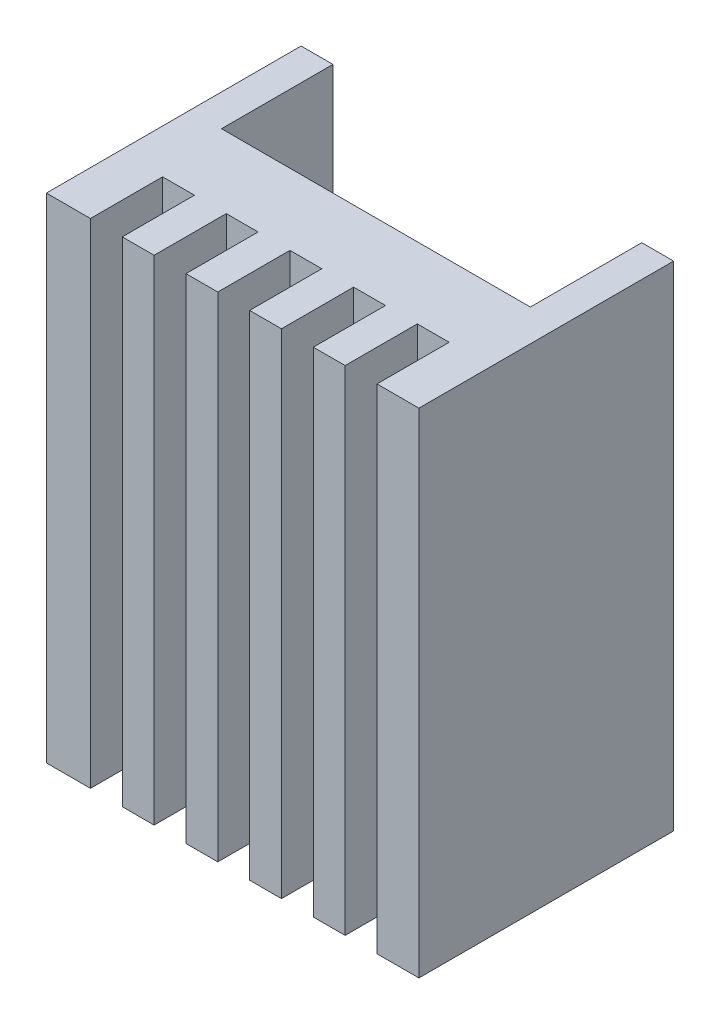
ISO-10303-21;
HEADER;
FILE_DESCRIPTION(('STEP AP214'),'2;1');
FILE_NAME('part.step','',(''),(''),'','','');
FILE_SCHEMA(('AUTOMOTIVE_DESIGN { 1 0 10303 214 1 1 1 1 }'));
ENDSEC;
DATA;
#1=APPLICATION_CONTEXT('core data for automotive mechanical design processes');
#2=APPLICATION_PROTOCOL_DEFINITION('international standard','automotive_design',2000,#1);
#3=PRODUCT_CONTEXT('',#1,'mechanical');
#4=PRODUCT('Part','Part','',(#3));
#5=PRODUCT_RELATED_PRODUCT_CATEGORY('part','',(#4));
#6=PRODUCT_DEFINITION_FORMATION('','',#4);
#7=PRODUCT_DEFINITION_CONTEXT('part definition',#1,'design');
#8=PRODUCT_DEFINITION('design','',#6,#7);
#9=PRODUCT_DEFINITION_SHAPE('','',#8);
#10=(LENGTH_UNIT() NAMED_UNIT(*) SI_UNIT(.MILLI.,.METRE.));
#11=(NAMED_UNIT(*) PLANE_ANGLE_UNIT() SI_UNIT($,.RADIAN.));
#12=(NAMED_UNIT(*) SI_UNIT($,.STERADIAN.) SOLID_ANGLE_UNIT());
#13=UNCERTAINTY_MEASURE_WITH_UNIT(LENGTH_MEASURE(1.E-05),#10,'distance_accuracy_value','');
#14=(GEOMETRIC_REPRESENTATION_CONTEXT(3) GLOBAL_UNCERTAINTY_ASSIGNED_CONTEXT((#13)) GLOBAL_UNIT_ASSIGNED_CONTEXT((#10,
#11,#12)) REPRESENTATION_CONTEXT('',''));
#15=CARTESIAN_POINT('',(0.,0.,0.));
#16=DIRECTION('',(0.,0.,1.));
#17=DIRECTION('',(1.,0.,0.));
#18=AXIS2_PLACEMENT_3D('',#15,#16,#17);
#19=CARTESIAN_POINT('',(0.,31.,0.));
#20=DIRECTION('',(0.,0.,-1.));
#21=DIRECTION('',(-1.,0.,0.));
#22=AXIS2_PLACEMENT_3D('',#19,#20,#21);
#23=PLANE('',#22);
#24=DIRECTION('',(1.,0.,0.));
#25=VECTOR('',#24,1.);
#26=CARTESIAN_POINT('',(0.,0.,0.));
#27=LINE('',#26,#25);
#28=CARTESIAN_POINT('',(16.7666688810726,0.,0.));
#29=VERTEX_POINT('',#28);
#30=CARTESIAN_POINT('',(18.7666688810726,0.,0.));
#31=VERTEX_POINT('',#30);
#32=EDGE_CURVE('E241',#29,#31,#27,.T.);
#33=ORIENTED_EDGE('',*,*,#32,.T.);
#34=DIRECTION('',(0.,1.,0.));
#35=VECTOR('',#34,1.);
#36=CARTESIAN_POINT('',(18.7666688810726,0.,0.));
#37=LINE('',#36,#35);
#38=CARTESIAN_POINT('',(18.7666688810726,31.,0.));
#39=VERTEX_POINT('',#38);
#40=EDGE_CURVE('E297',#31,#39,#37,.T.);
#41=ORIENTED_EDGE('',*,*,#40,.T.);
#42=DIRECTION('',(1.,0.,0.));
#43=VECTOR('',#42,1.);
#44=CARTESIAN_POINT('',(0.,31.,0.));
#45=LINE('',#44,#43);
#46=CARTESIAN_POINT('',(16.7666688810726,31.,0.));
#47=VERTEX_POINT('',#46);
#48=EDGE_CURVE('E431',#47,#39,#45,.T.);
#49=ORIENTED_EDGE('',*,*,#48,.F.);
#50=DIRECTION('',(0.,1.,0.));
#51=VECTOR('',#50,1.);
#52=CARTESIAN_POINT('',(16.7666688810726,0.,0.));
#53=LINE('',#52,#51);
#54=EDGE_CURVE('E285',#29,#47,#53,.T.);
#55=ORIENTED_EDGE('',*,*,#54,.F.);
#56=EDGE_LOOP('',(#33,#41,#49,#55));
#57=FACE_BOUND('',#56,.T.);
#58=ADVANCED_FACE('F32',(#57),#23,.F.);
#59=CARTESIAN_POINT('',(12.7666688810726,0.,0.));
#60=VERTEX_POINT('',#59);
#61=CARTESIAN_POINT('',(14.7666688810726,0.,0.));
#62=VERTEX_POINT('',#61);
#63=EDGE_CURVE('E246',#60,#62,#27,.T.);
#64=ORIENTED_EDGE('',*,*,#63,.T.);
#65=DIRECTION('',(0.,1.,0.));
#66=VECTOR('',#65,1.);
#67=CARTESIAN_POINT('',(14.7666688810726,0.,0.));
#68=LINE('',#67,#66);
#69=CARTESIAN_POINT('',(14.7666688810726,31.,0.));
#70=VERTEX_POINT('',#69);
#71=EDGE_CURVE('E274',#62,#70,#68,.T.);
#72=ORIENTED_EDGE('',*,*,#71,.T.);
#73=CARTESIAN_POINT('',(12.7666688810726,31.,0.));
#74=VERTEX_POINT('',#73);
#75=EDGE_CURVE('E432',#74,#70,#45,.T.);
#76=ORIENTED_EDGE('',*,*,#75,.F.);
#77=DIRECTION('',(0.,1.,0.));
#78=VECTOR('',#77,1.);
#79=CARTESIAN_POINT('',(12.7666688810726,0.,0.));
#80=LINE('',#79,#78);
#81=EDGE_CURVE('E276',#60,#74,#80,.T.);
#82=ORIENTED_EDGE('',*,*,#81,.F.);
#83=EDGE_LOOP('',(#64,#72,#76,#82));
#84=FACE_BOUND('',#83,.T.);
#85=ADVANCED_FACE('F272',(#84),#23,.F.);
#86=CARTESIAN_POINT('',(8.76666888107257,0.,0.));
#87=VERTEX_POINT('',#86);
#88=CARTESIAN_POINT('',(10.7666688810726,0.,0.));
#89=VERTEX_POINT('',#88);
#90=EDGE_CURVE('E257',#87,#89,#27,.T.);
#91=ORIENTED_EDGE('',*,*,#90,.T.);
#92=DIRECTION('',(0.,1.,0.));
#93=VECTOR('',#92,1.);
#94=CARTESIAN_POINT('',(10.7666688810726,0.,0.));
#95=LINE('',#94,#93);
#96=CARTESIAN_POINT('',(10.7666688810726,31.,0.));
#97=VERTEX_POINT('',#96);
#98=EDGE_CURVE('E320',#89,#97,#95,.T.);
#99=ORIENTED_EDGE('',*,*,#98,.T.);
#100=CARTESIAN_POINT('',(8.76666888107257,31.,0.));
#101=VERTEX_POINT('',#100);
#102=EDGE_CURVE('E436',#101,#97,#45,.T.);
#103=ORIENTED_EDGE('',*,*,#102,.F.);
#104=DIRECTION('',(0.,1.,0.));
#105=VECTOR('',#104,1.);
#106=CARTESIAN_POINT('',(8.76666888107257,0.,0.));
#107=LINE('',#106,#105);
#108=EDGE_CURVE('E338',#87,#101,#107,.T.);
#109=ORIENTED_EDGE('',*,*,#108,.F.);
#110=EDGE_LOOP('',(#91,#99,#103,#109));
#111=FACE_BOUND('',#110,.T.);
#112=ADVANCED_FACE('F458',(#111),#23,.F.);
#113=CARTESIAN_POINT('',(4.76666888107258,0.,0.));
#114=VERTEX_POINT('',#113);
#115=CARTESIAN_POINT('',(6.76666888107257,0.,0.));
#116=VERTEX_POINT('',#115);
#117=EDGE_CURVE('E252',#114,#116,#27,.T.);
#118=ORIENTED_EDGE('',*,*,#117,.T.);
#119=DIRECTION('',(0.,1.,0.));
#120=VECTOR('',#119,1.);
#121=CARTESIAN_POINT('',(6.76666888107257,0.,0.));
#122=LINE('',#121,#120);
#123=CARTESIAN_POINT('',(6.76666888107257,31.,0.));
#124=VERTEX_POINT('',#123);
#125=EDGE_CURVE('E345',#116,#124,#122,.T.);
#126=ORIENTED_EDGE('',*,*,#125,.T.);
#127=CARTESIAN_POINT('',(4.76666888107258,31.,0.));
#128=VERTEX_POINT('',#127);
#129=EDGE_CURVE('E384',#128,#124,#45,.T.);
#130=ORIENTED_EDGE('',*,*,#129,.F.);
#131=DIRECTION('',(0.,1.,0.));
#132=VECTOR('',#131,1.);
#133=CARTESIAN_POINT('',(4.76666888107258,0.,0.));
#134=LINE('',#133,#132);
#135=EDGE_CURVE('E373',#114,#128,#134,.T.);
#136=ORIENTED_EDGE('',*,*,#135,.F.);
#137=EDGE_LOOP('',(#118,#126,#130,#136));
#138=FACE_BOUND('',#137,.T.);
#139=ADVANCED_FACE('F449',(#138),#23,.F.);
#140=CARTESIAN_POINT('',(0.,0.,0.));
#141=VERTEX_POINT('',#140);
#142=CARTESIAN_POINT('',(2.76666888107258,0.,0.));
#143=VERTEX_POINT('',#142);
#144=EDGE_CURVE('E244',#141,#143,#27,.T.);
#145=ORIENTED_EDGE('',*,*,#144,.T.);
#146=DIRECTION('',(0.,1.,0.));
#147=VECTOR('',#146,1.);
#148=CARTESIAN_POINT('',(2.76666888107258,0.,0.));
#149=LINE('',#148,#147);
#150=CARTESIAN_POINT('',(2.76666888107258,31.,0.));
#151=VERTEX_POINT('',#150);
#152=EDGE_CURVE('E363',#143,#151,#149,.T.);
#153=ORIENTED_EDGE('',*,*,#152,.T.);
#154=CARTESIAN_POINT('',(0.,31.,0.));
#155=VERTEX_POINT('',#154);
#156=EDGE_CURVE('E380',#155,#151,#45,.T.);
#157=ORIENTED_EDGE('',*,*,#156,.F.);
#158=DIRECTION('',(0.,-1.,0.));
#159=VECTOR('',#158,1.);
#160=CARTESIAN_POINT('',(0.,31.,0.));
#161=LINE('',#160,#159);
#162=EDGE_CURVE('E11',#155,#141,#161,.T.);
#163=ORIENTED_EDGE('',*,*,#162,.T.);
#164=EDGE_LOOP('',(#145,#153,#157,#163));
#165=FACE_BOUND('',#164,.T.);
#166=ADVANCED_FACE('F486',(#165),#23,.F.);
#167=CARTESIAN_POINT('',(0.,31.,0.));
#168=DIRECTION('',(1.,0.,0.));
#169=DIRECTION('',(0.,0.,-1.));
#170=AXIS2_PLACEMENT_3D('',#167,#168,#169);
#171=PLANE('',#170);
#172=DIRECTION('',(0.,0.,1.));
#173=VECTOR('',#172,1.);
#174=CARTESIAN_POINT('',(0.,0.,0.));
#175=LINE('',#174,#173);
#176=CARTESIAN_POINT('',(0.,0.,-16.));
#177=VERTEX_POINT('',#176);
#178=EDGE_CURVE('E242',#177,#141,#175,.T.);
#179=ORIENTED_EDGE('',*,*,#178,.T.);
#180=ORIENTED_EDGE('',*,*,#162,.F.);
#181=DIRECTION('',(0.,0.,1.));
#182=VECTOR('',#181,1.);
#183=CARTESIAN_POINT('',(0.,31.,0.));
#184=LINE('',#183,#182);
#185=CARTESIAN_POINT('',(0.,31.,-16.));
#186=VERTEX_POINT('',#185);
#187=EDGE_CURVE('E376',#186,#155,#184,.T.);
#188=ORIENTED_EDGE('',*,*,#187,.F.);
#189=DIRECTION('',(0.,-1.,0.));
#190=VECTOR('',#189,1.);
#191=CARTESIAN_POINT('',(0.,31.,-16.));
#192=LINE('',#191,#190);
#193=EDGE_CURVE('E395',#186,#177,#192,.T.);
#194=ORIENTED_EDGE('',*,*,#193,.T.);
#195=EDGE_LOOP('',(#179,#180,#188,#194));
#196=FACE_BOUND('',#195,.T.);
#197=ADVANCED_FACE('F34',(#196),#171,.F.);
#198=CARTESIAN_POINT('',(20.7666688810726,31.,0.));
#199=VERTEX_POINT('',#198);
#200=CARTESIAN_POINT('',(23.4,31.,0.));
#201=VERTEX_POINT('',#200);
#202=EDGE_CURVE('E233',#199,#201,#45,.T.);
#203=ORIENTED_EDGE('',*,*,#202,.F.);
#204=DIRECTION('',(0.,1.,0.));
#205=VECTOR('',#204,1.);
#206=CARTESIAN_POINT('',(20.7666688810726,0.,0.));
#207=LINE('',#206,#205);
#208=CARTESIAN_POINT('',(20.7666688810726,0.,0.));
#209=VERTEX_POINT('',#208);
#210=EDGE_CURVE('E220',#209,#199,#207,.T.);
#211=ORIENTED_EDGE('',*,*,#210,.F.);
#212=CARTESIAN_POINT('',(23.4,0.,0.));
#213=VERTEX_POINT('',#212);
#214=EDGE_CURVE('E231',#209,#213,#27,.T.);
#215=ORIENTED_EDGE('',*,*,#214,.T.);
#216=DIRECTION('',(0.,-1.,0.));
#217=VECTOR('',#216,1.);
#218=CARTESIAN_POINT('',(23.4,31.,0.));
#219=LINE('',#218,#217);
#220=EDGE_CURVE('E40',#201,#213,#219,.T.);
#221=ORIENTED_EDGE('',*,*,#220,.F.);
#222=EDGE_LOOP('',(#203,#211,#215,#221));
#223=FACE_BOUND('',#222,.T.);
#224=ADVANCED_FACE('F229',(#223),#23,.F.);
#225=CARTESIAN_POINT('',(23.4,31.,0.));
#226=DIRECTION('',(-1.,0.,0.));
#227=DIRECTION('',(0.,0.,1.));
#228=AXIS2_PLACEMENT_3D('',#225,#226,#227);
#229=PLANE('',#228);
#230=DIRECTION('',(0.,0.,-1.));
#231=VECTOR('',#230,1.);
#232=CARTESIAN_POINT('',(23.4,0.,0.));
#233=LINE('',#232,#231);
#234=CARTESIAN_POINT('',(23.4,0.,-16.));
#235=VERTEX_POINT('',#234);
#236=EDGE_CURVE('E240',#213,#235,#233,.T.);
#237=ORIENTED_EDGE('',*,*,#236,.T.);
#238=DIRECTION('',(0.,-1.,0.));
#239=VECTOR('',#238,1.);
#240=CARTESIAN_POINT('',(23.4,31.,-16.));
#241=LINE('',#240,#239);
#242=CARTESIAN_POINT('',(23.4,31.,-16.));
#243=VERTEX_POINT('',#242);
#244=EDGE_CURVE('E419',#243,#235,#241,.T.);
#245=ORIENTED_EDGE('',*,*,#244,.F.);
#246=DIRECTION('',(0.,0.,-1.));
#247=VECTOR('',#246,1.);
#248=CARTESIAN_POINT('',(23.4,31.,0.));
#249=LINE('',#248,#247);
#250=EDGE_CURVE('E383',#201,#243,#249,.T.);
#251=ORIENTED_EDGE('',*,*,#250,.F.);
#252=ORIENTED_EDGE('',*,*,#220,.T.);
#253=EDGE_LOOP('',(#237,#245,#251,#252));
#254=FACE_BOUND('',#253,.T.);
#255=ADVANCED_FACE('F423',(#254),#229,.F.);
#256=CARTESIAN_POINT('',(21.4,31.,-16.));
#257=DIRECTION('',(0.,0.,1.));
#258=DIRECTION('',(1.,0.,0.));
#259=AXIS2_PLACEMENT_3D('',#256,#257,#258);
#260=PLANE('',#259);
#261=DIRECTION('',(-1.,0.,0.));
#262=VECTOR('',#261,1.);
#263=CARTESIAN_POINT('',(21.4,0.,-16.));
#264=LINE('',#263,#262);
#265=CARTESIAN_POINT('',(21.4,0.,-16.));
#266=VERTEX_POINT('',#265);
#267=EDGE_CURVE('E255',#235,#266,#264,.T.);
#268=ORIENTED_EDGE('',*,*,#267,.T.);
#269=DIRECTION('',(0.,-1.,0.));
#270=VECTOR('',#269,1.);
#271=CARTESIAN_POINT('',(21.4,31.,-16.));
#272=LINE('',#271,#270);
#273=CARTESIAN_POINT('',(21.4,31.,-16.));
#274=VERTEX_POINT('',#273);
#275=EDGE_CURVE('E416',#274,#266,#272,.T.);
#276=ORIENTED_EDGE('',*,*,#275,.F.);
#277=DIRECTION('',(-1.,0.,0.));
#278=VECTOR('',#277,1.);
#279=CARTESIAN_POINT('',(21.4,31.,-16.));
#280=LINE('',#279,#278);
#281=EDGE_CURVE('E386',#243,#274,#280,.T.);
#282=ORIENTED_EDGE('',*,*,#281,.F.);
#283=ORIENTED_EDGE('',*,*,#244,.T.);
#284=EDGE_LOOP('',(#268,#276,#282,#283));
#285=FACE_BOUND('',#284,.T.);
#286=ADVANCED_FACE('F491',(#285),#260,.F.);
#287=CARTESIAN_POINT('',(21.4,31.,-16.));
#288=DIRECTION('',(1.,0.,0.));
#289=DIRECTION('',(0.,0.,-1.));
#290=AXIS2_PLACEMENT_3D('',#287,#288,#289);
#291=PLANE('',#290);
#292=DIRECTION('',(0.,0.,1.));
#293=VECTOR('',#292,1.);
#294=CARTESIAN_POINT('',(21.4,0.,-16.));
#295=LINE('',#294,#293);
#296=CARTESIAN_POINT('',(21.4,0.,-9.));
#297=VERTEX_POINT('',#296);
#298=EDGE_CURVE('E744',#266,#297,#295,.T.);
#299=ORIENTED_EDGE('',*,*,#298,.T.);
#300=DIRECTION('',(0.,-1.,0.));
#301=VECTOR('',#300,1.);
#302=CARTESIAN_POINT('',(21.4,31.,-9.));
#303=LINE('',#302,#301);
#304=CARTESIAN_POINT('',(21.4,31.,-9.));
#305=VERTEX_POINT('',#304);
#306=EDGE_CURVE('E413',#305,#297,#303,.T.);
#307=ORIENTED_EDGE('',*,*,#306,.F.);
#308=DIRECTION('',(0.,0.,1.));
#309=VECTOR('',#308,1.);
#310=CARTESIAN_POINT('',(21.4,31.,-16.));
#311=LINE('',#310,#309);
#312=EDGE_CURVE('E388',#274,#305,#311,.T.);
#313=ORIENTED_EDGE('',*,*,#312,.F.);
#314=ORIENTED_EDGE('',*,*,#275,.T.);
#315=EDGE_LOOP('',(#299,#307,#313,#314));
#316=FACE_BOUND('',#315,.T.);
#317=ADVANCED_FACE('F542',(#316),#291,.F.);
#318=CARTESIAN_POINT('',(2.,31.,-9.));
#319=DIRECTION('',(0.,0.,1.));
#320=DIRECTION('',(1.,0.,0.));
#321=AXIS2_PLACEMENT_3D('',#318,#319,#320);
#322=PLANE('',#321);
#323=DIRECTION('',(-1.,0.,0.));
#324=VECTOR('',#323,1.);
#325=CARTESIAN_POINT('',(2.,0.,-9.));
#326=LINE('',#325,#324);
#327=CARTESIAN_POINT('',(2.,0.,-9.));
#328=VERTEX_POINT('',#327);
#329=EDGE_CURVE('E742',#297,#328,#326,.T.);
#330=ORIENTED_EDGE('',*,*,#329,.T.);
#331=DIRECTION('',(0.,-1.,0.));
#332=VECTOR('',#331,1.);
#333=CARTESIAN_POINT('',(2.,31.,-9.));
#334=LINE('',#333,#332);
#335=CARTESIAN_POINT('',(2.,31.,-9.));
#336=VERTEX_POINT('',#335);
#337=EDGE_CURVE('E406',#336,#328,#334,.T.);
#338=ORIENTED_EDGE('',*,*,#337,.F.);
#339=DIRECTION('',(-1.,0.,0.));
#340=VECTOR('',#339,1.);
#341=CARTESIAN_POINT('',(2.,31.,-9.));
#342=LINE('',#341,#340);
#343=EDGE_CURVE('E390',#305,#336,#342,.T.);
#344=ORIENTED_EDGE('',*,*,#343,.F.);
#345=ORIENTED_EDGE('',*,*,#306,.T.);
#346=EDGE_LOOP('',(#330,#338,#344,#345));
#347=FACE_BOUND('',#346,.T.);
#348=ADVANCED_FACE('F532',(#347),#322,.F.);
#349=CARTESIAN_POINT('',(2.,31.,-16.));
#350=DIRECTION('',(-1.,0.,0.));
#351=DIRECTION('',(0.,0.,1.));
#352=AXIS2_PLACEMENT_3D('',#349,#350,#351);
#353=PLANE('',#352);
#354=DIRECTION('',(0.,0.,-1.));
#355=VECTOR('',#354,1.);
#356=CARTESIAN_POINT('',(2.,0.,-16.));
#357=LINE('',#356,#355);
#358=CARTESIAN_POINT('',(2.,0.,-16.));
#359=VERTEX_POINT('',#358);
#360=EDGE_CURVE('E741',#328,#359,#357,.T.);
#361=ORIENTED_EDGE('',*,*,#360,.T.);
#362=DIRECTION('',(0.,-1.,0.));
#363=VECTOR('',#362,1.);
#364=CARTESIAN_POINT('',(2.,31.,-16.));
#365=LINE('',#364,#363);
#366=CARTESIAN_POINT('',(2.,31.,-16.));
#367=VERTEX_POINT('',#366);
#368=EDGE_CURVE('E400',#367,#359,#365,.T.);
#369=ORIENTED_EDGE('',*,*,#368,.F.);
#370=DIRECTION('',(0.,0.,-1.));
#371=VECTOR('',#370,1.);
#372=CARTESIAN_POINT('',(2.,31.,-16.));
#373=LINE('',#372,#371);
#374=EDGE_CURVE('E392',#336,#367,#373,.T.);
#375=ORIENTED_EDGE('',*,*,#374,.F.);
#376=ORIENTED_EDGE('',*,*,#337,.T.);
#377=EDGE_LOOP('',(#361,#369,#375,#376));
#378=FACE_BOUND('',#377,.T.);
#379=ADVANCED_FACE('F520',(#378),#353,.F.);
#380=CARTESIAN_POINT('',(0.,31.,-16.));
#381=DIRECTION('',(0.,0.,1.));
#382=DIRECTION('',(1.,0.,0.));
#383=AXIS2_PLACEMENT_3D('',#380,#381,#382);
#384=PLANE('',#383);
#385=DIRECTION('',(-1.,0.,0.));
#386=VECTOR('',#385,1.);
#387=CARTESIAN_POINT('',(0.,0.,-16.));
#388=LINE('',#387,#386);
#389=EDGE_CURVE('E379',#359,#177,#388,.T.);
#390=ORIENTED_EDGE('',*,*,#389,.T.);
#391=ORIENTED_EDGE('',*,*,#193,.F.);
#392=DIRECTION('',(-1.,0.,0.));
#393=VECTOR('',#392,1.);
#394=CARTESIAN_POINT('',(0.,31.,-16.));
#395=LINE('',#394,#393);
#396=EDGE_CURVE('E394',#367,#186,#395,.T.);
#397=ORIENTED_EDGE('',*,*,#396,.F.);
#398=ORIENTED_EDGE('',*,*,#368,.T.);
#399=EDGE_LOOP('',(#390,#391,#397,#398));
#400=FACE_BOUND('',#399,.T.);
#401=ADVANCED_FACE('F515',(#400),#384,.F.);
#402=CARTESIAN_POINT('',(0.,31.,0.));
#403=DIRECTION('',(0.,-1.,0.));
#404=DIRECTION('',(0.,0.,-1.));
#405=AXIS2_PLACEMENT_3D('',#402,#403,#404);
#406=PLANE('',#405);
#407=ORIENTED_EDGE('',*,*,#48,.T.);
#408=DIRECTION('',(0.,0.,1.));
#409=VECTOR('',#408,1.);
#410=CARTESIAN_POINT('',(18.7666688810726,31.,0.));
#411=LINE('',#410,#409);
#412=CARTESIAN_POINT('',(18.7666688810726,31.,-4.53354486090518));
#413=VERTEX_POINT('',#412);
#414=EDGE_CURVE('E225',#413,#39,#411,.T.);
#415=ORIENTED_EDGE('',*,*,#414,.F.);
#416=DIRECTION('',(-1.,0.,0.));
#417=VECTOR('',#416,1.);
#418=CARTESIAN_POINT('',(18.7666688810726,31.,-4.53354486090518));
#419=LINE('',#418,#417);
#420=CARTESIAN_POINT('',(20.7666688810726,31.,-4.53354486090518));
#421=VERTEX_POINT('',#420);
#422=EDGE_CURVE('E719',#421,#413,#419,.T.);
#423=ORIENTED_EDGE('',*,*,#422,.F.);
#424=DIRECTION('',(0.,0.,-1.));
#425=VECTOR('',#424,1.);
#426=CARTESIAN_POINT('',(20.7666688810726,31.,0.));
#427=LINE('',#426,#425);
#428=EDGE_CURVE('E430',#199,#421,#427,.T.);
#429=ORIENTED_EDGE('',*,*,#428,.F.);
#430=ORIENTED_EDGE('',*,*,#202,.T.);
#431=ORIENTED_EDGE('',*,*,#250,.T.);
#432=ORIENTED_EDGE('',*,*,#281,.T.);
#433=ORIENTED_EDGE('',*,*,#312,.T.);
#434=ORIENTED_EDGE('',*,*,#343,.T.);
#435=ORIENTED_EDGE('',*,*,#374,.T.);
#436=ORIENTED_EDGE('',*,*,#396,.T.);
#437=ORIENTED_EDGE('',*,*,#187,.T.);
#438=ORIENTED_EDGE('',*,*,#156,.T.);
#439=DIRECTION('',(0.,0.,1.));
#440=VECTOR('',#439,1.);
#441=CARTESIAN_POINT('',(2.76666888107258,31.,0.));
#442=LINE('',#441,#440);
#443=CARTESIAN_POINT('',(2.76666888107258,31.,-4.53354486090518));
#444=VERTEX_POINT('',#443);
#445=EDGE_CURVE('E347',#444,#151,#442,.T.);
#446=ORIENTED_EDGE('',*,*,#445,.F.);
#447=DIRECTION('',(-1.,0.,0.));
#448=VECTOR('',#447,1.);
#449=CARTESIAN_POINT('',(2.76666888107258,31.,-4.53354486090518));
#450=LINE('',#449,#448);
#451=CARTESIAN_POINT('',(4.76666888107258,31.,-4.53354486090518));
#452=VERTEX_POINT('',#451);
#453=EDGE_CURVE('E357',#452,#444,#450,.T.);
#454=ORIENTED_EDGE('',*,*,#453,.F.);
#455=DIRECTION('',(0.,0.,-1.));
#456=VECTOR('',#455,1.);
#457=CARTESIAN_POINT('',(4.76666888107258,31.,0.));
#458=LINE('',#457,#456);
#459=EDGE_CURVE('E365',#128,#452,#458,.T.);
#460=ORIENTED_EDGE('',*,*,#459,.F.);
#461=ORIENTED_EDGE('',*,*,#129,.T.);
#462=DIRECTION('',(0.,0.,1.));
#463=VECTOR('',#462,1.);
#464=CARTESIAN_POINT('',(6.76666888107257,31.,0.));
#465=LINE('',#464,#463);
#466=CARTESIAN_POINT('',(6.76666888107257,31.,-4.53354486090518));
#467=VERTEX_POINT('',#466);
#468=EDGE_CURVE('E332',#467,#124,#465,.T.);
#469=ORIENTED_EDGE('',*,*,#468,.F.);
#470=DIRECTION('',(-1.,0.,0.));
#471=VECTOR('',#470,1.);
#472=CARTESIAN_POINT('',(6.76666888107257,31.,-4.53354486090518));
#473=LINE('',#472,#471);
#474=CARTESIAN_POINT('',(8.76666888107257,31.,-4.53354486090518));
#475=VERTEX_POINT('',#474);
#476=EDGE_CURVE('E341',#475,#467,#473,.T.);
#477=ORIENTED_EDGE('',*,*,#476,.F.);
#478=DIRECTION('',(0.,0.,-1.));
#479=VECTOR('',#478,1.);
#480=CARTESIAN_POINT('',(8.76666888107257,31.,0.));
#481=LINE('',#480,#479);
#482=EDGE_CURVE('E322',#101,#475,#481,.T.);
#483=ORIENTED_EDGE('',*,*,#482,.F.);
#484=ORIENTED_EDGE('',*,*,#102,.T.);
#485=DIRECTION('',(0.,0.,1.));
#486=VECTOR('',#485,1.);
#487=CARTESIAN_POINT('',(10.7666688810726,31.,0.));
#488=LINE('',#487,#486);
#489=CARTESIAN_POINT('',(10.7666688810726,31.,-4.53354486090518));
#490=VERTEX_POINT('',#489);
#491=EDGE_CURVE('E309',#490,#97,#488,.T.);
#492=ORIENTED_EDGE('',*,*,#491,.F.);
#493=DIRECTION('',(-1.,0.,0.));
#494=VECTOR('',#493,1.);
#495=CARTESIAN_POINT('',(10.7666688810726,31.,-4.53354486090518));
#496=LINE('',#495,#494);
#497=CARTESIAN_POINT('',(12.7666688810726,31.,-4.53354486090518));
#498=VERTEX_POINT('',#497);
#499=EDGE_CURVE('E316',#498,#490,#496,.T.);
#500=ORIENTED_EDGE('',*,*,#499,.F.);
#501=DIRECTION('',(0.,0.,-1.));
#502=VECTOR('',#501,1.);
#503=CARTESIAN_POINT('',(12.7666688810726,31.,0.));
#504=LINE('',#503,#502);
#505=EDGE_CURVE('E303',#74,#498,#504,.T.);
#506=ORIENTED_EDGE('',*,*,#505,.F.);
#507=ORIENTED_EDGE('',*,*,#75,.T.);
#508=DIRECTION('',(0.,0.,1.));
#509=VECTOR('',#508,1.);
#510=CARTESIAN_POINT('',(14.7666688810726,31.,0.));
#511=LINE('',#510,#509);
#512=CARTESIAN_POINT('',(14.7666688810726,31.,-4.53354486090518));
#513=VERTEX_POINT('',#512);
#514=EDGE_CURVE('E300',#513,#70,#511,.T.);
#515=ORIENTED_EDGE('',*,*,#514,.F.);
#516=DIRECTION('',(-1.,0.,0.));
#517=VECTOR('',#516,1.);
#518=CARTESIAN_POINT('',(14.7666688810726,31.,-4.53354486090518));
#519=LINE('',#518,#517);
#520=CARTESIAN_POINT('',(16.7666688810726,31.,-4.53354486090518));
#521=VERTEX_POINT('',#520);
#522=EDGE_CURVE('E296',#521,#513,#519,.T.);
#523=ORIENTED_EDGE('',*,*,#522,.F.);
#524=DIRECTION('',(0.,0.,-1.));
#525=VECTOR('',#524,1.);
#526=CARTESIAN_POINT('',(16.7666688810726,31.,0.));
#527=LINE('',#526,#525);
#528=EDGE_CURVE('E293',#47,#521,#527,.T.);
#529=ORIENTED_EDGE('',*,*,#528,.F.);
#530=EDGE_LOOP('',(#407,#415,#423,#429,#430,#431,#432,#433,#434,#435,#436,#437,#438,#446,#454,
#460,#461,#469,#477,#483,#484,#492,#500,#506,#507,#515,#523,#529));
#531=FACE_BOUND('',#530,.T.);
#532=ADVANCED_FACE('F427',(#531),#406,.F.);
#533=CARTESIAN_POINT('',(0.,0.,0.));
#534=DIRECTION('',(0.,-1.,0.));
#535=DIRECTION('',(0.,0.,-1.));
#536=AXIS2_PLACEMENT_3D('',#533,#534,#535);
#537=PLANE('',#536);
#538=DIRECTION('',(0.,0.,1.));
#539=VECTOR('',#538,1.);
#540=CARTESIAN_POINT('',(18.7666688810726,0.,0.));
#541=LINE('',#540,#539);
#542=CARTESIAN_POINT('',(18.7666688810726,0.,-4.53354486090518));
#543=VERTEX_POINT('',#542);
#544=EDGE_CURVE('E234',#543,#31,#541,.T.);
#545=ORIENTED_EDGE('',*,*,#544,.T.);
#546=ORIENTED_EDGE('',*,*,#32,.F.);
#547=DIRECTION('',(0.,0.,-1.));
#548=VECTOR('',#547,1.);
#549=CARTESIAN_POINT('',(16.7666688810726,0.,0.));
#550=LINE('',#549,#548);
#551=CARTESIAN_POINT('',(16.7666688810726,0.,-4.53354486090518));
#552=VERTEX_POINT('',#551);
#553=EDGE_CURVE('E289',#29,#552,#550,.T.);
#554=ORIENTED_EDGE('',*,*,#553,.T.);
#555=DIRECTION('',(-1.,0.,0.));
#556=VECTOR('',#555,1.);
#557=CARTESIAN_POINT('',(14.7666688810726,0.,-4.53354486090518));
#558=LINE('',#557,#556);
#559=CARTESIAN_POINT('',(14.7666688810726,0.,-4.53354486090518));
#560=VERTEX_POINT('',#559);
#561=EDGE_CURVE('E55',#552,#560,#558,.T.);
#562=ORIENTED_EDGE('',*,*,#561,.T.);
#563=DIRECTION('',(0.,0.,1.));
#564=VECTOR('',#563,1.);
#565=CARTESIAN_POINT('',(14.7666688810726,0.,0.));
#566=LINE('',#565,#564);
#567=EDGE_CURVE('E282',#560,#62,#566,.T.);
#568=ORIENTED_EDGE('',*,*,#567,.T.);
#569=ORIENTED_EDGE('',*,*,#63,.F.);
#570=DIRECTION('',(0.,0.,-1.));
#571=VECTOR('',#570,1.);
#572=CARTESIAN_POINT('',(12.7666688810726,0.,0.));
#573=LINE('',#572,#571);
#574=CARTESIAN_POINT('',(12.7666688810726,0.,-4.53354486090518));
#575=VERTEX_POINT('',#574);
#576=EDGE_CURVE('E280',#60,#575,#573,.T.);
#577=ORIENTED_EDGE('',*,*,#576,.T.);
#578=DIRECTION('',(-1.,0.,0.));
#579=VECTOR('',#578,1.);
#580=CARTESIAN_POINT('',(10.7666688810726,0.,-4.53354486090518));
#581=LINE('',#580,#579);
#582=CARTESIAN_POINT('',(10.7666688810726,0.,-4.53354486090518));
#583=VERTEX_POINT('',#582);
#584=EDGE_CURVE('E308',#575,#583,#581,.T.);
#585=ORIENTED_EDGE('',*,*,#584,.T.);
#586=DIRECTION('',(0.,0.,1.));
#587=VECTOR('',#586,1.);
#588=CARTESIAN_POINT('',(10.7666688810726,0.,0.));
#589=LINE('',#588,#587);
#590=EDGE_CURVE('E311',#583,#89,#589,.T.);
#591=ORIENTED_EDGE('',*,*,#590,.T.);
#592=ORIENTED_EDGE('',*,*,#90,.F.);
#593=DIRECTION('',(0.,0.,-1.));
#594=VECTOR('',#593,1.);
#595=CARTESIAN_POINT('',(8.76666888107257,0.,0.));
#596=LINE('',#595,#594);
#597=CARTESIAN_POINT('',(8.76666888107257,0.,-4.53354486090518));
#598=VERTEX_POINT('',#597);
#599=EDGE_CURVE('E328',#87,#598,#596,.T.);
#600=ORIENTED_EDGE('',*,*,#599,.T.);
#601=DIRECTION('',(-1.,0.,0.));
#602=VECTOR('',#601,1.);
#603=CARTESIAN_POINT('',(6.76666888107257,0.,-4.53354486090518));
#604=LINE('',#603,#602);
#605=CARTESIAN_POINT('',(6.76666888107257,0.,-4.53354486090518));
#606=VERTEX_POINT('',#605);
#607=EDGE_CURVE('E331',#598,#606,#604,.T.);
#608=ORIENTED_EDGE('',*,*,#607,.T.);
#609=DIRECTION('',(0.,0.,1.));
#610=VECTOR('',#609,1.);
#611=CARTESIAN_POINT('',(6.76666888107257,0.,0.));
#612=LINE('',#611,#610);
#613=EDGE_CURVE('E335',#606,#116,#612,.T.);
#614=ORIENTED_EDGE('',*,*,#613,.T.);
#615=ORIENTED_EDGE('',*,*,#117,.F.);
#616=DIRECTION('',(0.,0.,-1.));
#617=VECTOR('',#616,1.);
#618=CARTESIAN_POINT('',(4.76666888107258,0.,0.));
#619=LINE('',#618,#617);
#620=CARTESIAN_POINT('',(4.76666888107258,0.,-4.53354486090518));
#621=VERTEX_POINT('',#620);
#622=EDGE_CURVE('E356',#114,#621,#619,.T.);
#623=ORIENTED_EDGE('',*,*,#622,.T.);
#624=DIRECTION('',(-1.,0.,0.));
#625=VECTOR('',#624,1.);
#626=CARTESIAN_POINT('',(2.76666888107258,0.,-4.53354486090518));
#627=LINE('',#626,#625);
#628=CARTESIAN_POINT('',(2.76666888107258,0.,-4.53354486090518));
#629=VERTEX_POINT('',#628);
#630=EDGE_CURVE('E360',#621,#629,#627,.T.);
#631=ORIENTED_EDGE('',*,*,#630,.T.);
#632=DIRECTION('',(0.,0.,1.));
#633=VECTOR('',#632,1.);
#634=CARTESIAN_POINT('',(2.76666888107258,0.,0.));
#635=LINE('',#634,#633);
#636=EDGE_CURVE('E353',#629,#143,#635,.T.);
#637=ORIENTED_EDGE('',*,*,#636,.T.);
#638=ORIENTED_EDGE('',*,*,#144,.F.);
#639=ORIENTED_EDGE('',*,*,#178,.F.);
#640=ORIENTED_EDGE('',*,*,#389,.F.);
#641=ORIENTED_EDGE('',*,*,#360,.F.);
#642=ORIENTED_EDGE('',*,*,#329,.F.);
#643=ORIENTED_EDGE('',*,*,#298,.F.);
#644=ORIENTED_EDGE('',*,*,#267,.F.);
#645=ORIENTED_EDGE('',*,*,#236,.F.);
#646=ORIENTED_EDGE('',*,*,#214,.F.);
#647=DIRECTION('',(0.,0.,-1.));
#648=VECTOR('',#647,1.);
#649=CARTESIAN_POINT('',(20.7666688810726,0.,0.));
#650=LINE('',#649,#648);
#651=CARTESIAN_POINT('',(20.7666688810726,0.,-4.53354486090518));
#652=VERTEX_POINT('',#651);
#653=EDGE_CURVE('E216',#209,#652,#650,.T.);
#654=ORIENTED_EDGE('',*,*,#653,.T.);
#655=DIRECTION('',(-1.,0.,0.));
#656=VECTOR('',#655,1.);
#657=CARTESIAN_POINT('',(18.7666688810726,0.,-4.53354486090518));
#658=LINE('',#657,#656);
#659=EDGE_CURVE('E47',#652,#543,#658,.T.);
#660=ORIENTED_EDGE('',*,*,#659,.T.);
#661=EDGE_LOOP('',(#545,#546,#554,#562,#568,#569,#577,#585,#591,#592,#600,#608,#614,#615,#623,
#631,#637,#638,#639,#640,#641,#642,#643,#644,#645,#646,#654,#660));
#662=FACE_BOUND('',#661,.T.);
#663=ADVANCED_FACE('F238',(#662),#537,.T.);
#664=CARTESIAN_POINT('',(2.76666888107258,0.,0.));
#665=DIRECTION('',(-1.,0.,0.));
#666=DIRECTION('',(0.,0.,1.));
#667=AXIS2_PLACEMENT_3D('',#664,#665,#666);
#668=PLANE('',#667);
#669=ORIENTED_EDGE('',*,*,#445,.T.);
#670=ORIENTED_EDGE('',*,*,#152,.F.);
#671=ORIENTED_EDGE('',*,*,#636,.F.);
#672=DIRECTION('',(0.,1.,0.));
#673=VECTOR('',#672,1.);
#674=CARTESIAN_POINT('',(2.76666888107258,0.,-4.53354486090518));
#675=LINE('',#674,#673);
#676=EDGE_CURVE('E248',#629,#444,#675,.T.);
#677=ORIENTED_EDGE('',*,*,#676,.T.);
#678=EDGE_LOOP('',(#669,#670,#671,#677));
#679=FACE_BOUND('',#678,.T.);
#680=ADVANCED_FACE('F594',(#679),#668,.F.);
#681=CARTESIAN_POINT('',(2.76666888107258,0.,-4.53354486090518));
#682=DIRECTION('',(0.,0.,-1.));
#683=DIRECTION('',(-1.,0.,0.));
#684=AXIS2_PLACEMENT_3D('',#681,#682,#683);
#685=PLANE('',#684);
#686=ORIENTED_EDGE('',*,*,#453,.T.);
#687=ORIENTED_EDGE('',*,*,#676,.F.);
#688=ORIENTED_EDGE('',*,*,#630,.F.);
#689=DIRECTION('',(0.,1.,0.));
#690=VECTOR('',#689,1.);
#691=CARTESIAN_POINT('',(4.76666888107258,0.,-4.53354486090518));
#692=LINE('',#691,#690);
#693=EDGE_CURVE('E371',#621,#452,#692,.T.);
#694=ORIENTED_EDGE('',*,*,#693,.T.);
#695=EDGE_LOOP('',(#686,#687,#688,#694));
#696=FACE_BOUND('',#695,.T.);
#697=ADVANCED_FACE('F602',(#696),#685,.F.);
#698=CARTESIAN_POINT('',(4.76666888107258,0.,0.));
#699=DIRECTION('',(1.,0.,0.));
#700=DIRECTION('',(0.,0.,-1.));
#701=AXIS2_PLACEMENT_3D('',#698,#699,#700);
#702=PLANE('',#701);
#703=ORIENTED_EDGE('',*,*,#459,.T.);
#704=ORIENTED_EDGE('',*,*,#693,.F.);
#705=ORIENTED_EDGE('',*,*,#622,.F.);
#706=ORIENTED_EDGE('',*,*,#135,.T.);
#707=EDGE_LOOP('',(#703,#704,#705,#706));
#708=FACE_BOUND('',#707,.T.);
#709=ADVANCED_FACE('F612',(#708),#702,.F.);
#710=CARTESIAN_POINT('',(6.76666888107257,0.,0.));
#711=DIRECTION('',(-1.,0.,0.));
#712=DIRECTION('',(0.,0.,1.));
#713=AXIS2_PLACEMENT_3D('',#710,#711,#712);
#714=PLANE('',#713);
#715=ORIENTED_EDGE('',*,*,#468,.T.);
#716=ORIENTED_EDGE('',*,*,#125,.F.);
#717=ORIENTED_EDGE('',*,*,#613,.F.);
#718=DIRECTION('',(0.,1.,0.));
#719=VECTOR('',#718,1.);
#720=CARTESIAN_POINT('',(6.76666888107257,0.,-4.53354486090518));
#721=LINE('',#720,#719);
#722=EDGE_CURVE('E348',#606,#467,#721,.T.);
#723=ORIENTED_EDGE('',*,*,#722,.T.);
#724=EDGE_LOOP('',(#715,#716,#717,#723));
#725=FACE_BOUND('',#724,.T.);
#726=ADVANCED_FACE('F452',(#725),#714,.F.);
#727=CARTESIAN_POINT('',(6.76666888107257,0.,-4.53354486090518));
#728=DIRECTION('',(0.,0.,-1.));
#729=DIRECTION('',(-1.,0.,0.));
#730=AXIS2_PLACEMENT_3D('',#727,#728,#729);
#731=PLANE('',#730);
#732=ORIENTED_EDGE('',*,*,#476,.T.);
#733=ORIENTED_EDGE('',*,*,#722,.F.);
#734=ORIENTED_EDGE('',*,*,#607,.F.);
#735=DIRECTION('',(0.,1.,0.));
#736=VECTOR('',#735,1.);
#737=CARTESIAN_POINT('',(8.76666888107257,0.,-4.53354486090518));
#738=LINE('',#737,#736);
#739=EDGE_CURVE('E350',#598,#475,#738,.T.);
#740=ORIENTED_EDGE('',*,*,#739,.T.);
#741=EDGE_LOOP('',(#732,#733,#734,#740));
#742=FACE_BOUND('',#741,.T.);
#743=ADVANCED_FACE('F455',(#742),#731,.F.);
#744=CARTESIAN_POINT('',(8.76666888107257,0.,0.));
#745=DIRECTION('',(1.,0.,0.));
#746=DIRECTION('',(0.,0.,-1.));
#747=AXIS2_PLACEMENT_3D('',#744,#745,#746);
#748=PLANE('',#747);
#749=ORIENTED_EDGE('',*,*,#482,.T.);
#750=ORIENTED_EDGE('',*,*,#739,.F.);
#751=ORIENTED_EDGE('',*,*,#599,.F.);
#752=ORIENTED_EDGE('',*,*,#108,.T.);
#753=EDGE_LOOP('',(#749,#750,#751,#752));
#754=FACE_BOUND('',#753,.T.);
#755=ADVANCED_FACE('F457',(#754),#748,.F.);
#756=CARTESIAN_POINT('',(10.7666688810726,0.,0.));
#757=DIRECTION('',(-1.,0.,0.));
#758=DIRECTION('',(0.,0.,1.));
#759=AXIS2_PLACEMENT_3D('',#756,#757,#758);
#760=PLANE('',#759);
#761=ORIENTED_EDGE('',*,*,#491,.T.);
#762=ORIENTED_EDGE('',*,*,#98,.F.);
#763=ORIENTED_EDGE('',*,*,#590,.F.);
#764=DIRECTION('',(0.,1.,0.));
#765=VECTOR('',#764,1.);
#766=CARTESIAN_POINT('',(10.7666688810726,0.,-4.53354486090518));
#767=LINE('',#766,#765);
#768=EDGE_CURVE('E323',#583,#490,#767,.T.);
#769=ORIENTED_EDGE('',*,*,#768,.T.);
#770=EDGE_LOOP('',(#761,#762,#763,#769));
#771=FACE_BOUND('',#770,.T.);
#772=ADVANCED_FACE('F461',(#771),#760,.F.);
#773=CARTESIAN_POINT('',(10.7666688810726,0.,-4.53354486090518));
#774=DIRECTION('',(0.,0.,-1.));
#775=DIRECTION('',(-1.,0.,0.));
#776=AXIS2_PLACEMENT_3D('',#773,#774,#775);
#777=PLANE('',#776);
#778=ORIENTED_EDGE('',*,*,#499,.T.);
#779=ORIENTED_EDGE('',*,*,#768,.F.);
#780=ORIENTED_EDGE('',*,*,#584,.F.);
#781=DIRECTION('',(0.,1.,0.));
#782=VECTOR('',#781,1.);
#783=CARTESIAN_POINT('',(12.7666688810726,0.,-4.53354486090518));
#784=LINE('',#783,#782);
#785=EDGE_CURVE('E325',#575,#498,#784,.T.);
#786=ORIENTED_EDGE('',*,*,#785,.T.);
#787=EDGE_LOOP('',(#778,#779,#780,#786));
#788=FACE_BOUND('',#787,.T.);
#789=ADVANCED_FACE('F464',(#788),#777,.F.);
#790=CARTESIAN_POINT('',(12.7666688810726,0.,0.));
#791=DIRECTION('',(1.,0.,0.));
#792=DIRECTION('',(0.,0.,-1.));
#793=AXIS2_PLACEMENT_3D('',#790,#791,#792);
#794=PLANE('',#793);
#795=ORIENTED_EDGE('',*,*,#505,.T.);
#796=ORIENTED_EDGE('',*,*,#785,.F.);
#797=ORIENTED_EDGE('',*,*,#576,.F.);
#798=ORIENTED_EDGE('',*,*,#81,.T.);
#799=EDGE_LOOP('',(#795,#796,#797,#798));
#800=FACE_BOUND('',#799,.T.);
#801=ADVANCED_FACE('F466',(#800),#794,.F.);
#802=CARTESIAN_POINT('',(14.7666688810726,0.,0.));
#803=DIRECTION('',(-1.,0.,0.));
#804=DIRECTION('',(0.,0.,1.));
#805=AXIS2_PLACEMENT_3D('',#802,#803,#804);
#806=PLANE('',#805);
#807=ORIENTED_EDGE('',*,*,#514,.T.);
#808=ORIENTED_EDGE('',*,*,#71,.F.);
#809=ORIENTED_EDGE('',*,*,#567,.F.);
#810=DIRECTION('',(0.,1.,0.));
#811=VECTOR('',#810,1.);
#812=CARTESIAN_POINT('',(14.7666688810726,0.,-4.53354486090518));
#813=LINE('',#812,#811);
#814=EDGE_CURVE('E304',#560,#513,#813,.T.);
#815=ORIENTED_EDGE('',*,*,#814,.T.);
#816=EDGE_LOOP('',(#807,#808,#809,#815));
#817=FACE_BOUND('',#816,.T.);
#818=ADVANCED_FACE('F469',(#817),#806,.F.);
#819=CARTESIAN_POINT('',(14.7666688810726,0.,-4.53354486090518));
#820=DIRECTION('',(0.,0.,-1.));
#821=DIRECTION('',(-1.,0.,0.));
#822=AXIS2_PLACEMENT_3D('',#819,#820,#821);
#823=PLANE('',#822);
#824=ORIENTED_EDGE('',*,*,#522,.T.);
#825=ORIENTED_EDGE('',*,*,#814,.F.);
#826=ORIENTED_EDGE('',*,*,#561,.F.);
#827=DIRECTION('',(0.,1.,0.));
#828=VECTOR('',#827,1.);
#829=CARTESIAN_POINT('',(16.7666688810726,0.,-4.53354486090518));
#830=LINE('',#829,#828);
#831=EDGE_CURVE('E287',#552,#521,#830,.T.);
#832=ORIENTED_EDGE('',*,*,#831,.T.);
#833=EDGE_LOOP('',(#824,#825,#826,#832));
#834=FACE_BOUND('',#833,.T.);
#835=ADVANCED_FACE('F475',(#834),#823,.F.);
#836=CARTESIAN_POINT('',(16.7666688810726,0.,0.));
#837=DIRECTION('',(1.,0.,0.));
#838=DIRECTION('',(0.,0.,-1.));
#839=AXIS2_PLACEMENT_3D('',#836,#837,#838);
#840=PLANE('',#839);
#841=ORIENTED_EDGE('',*,*,#528,.T.);
#842=ORIENTED_EDGE('',*,*,#831,.F.);
#843=ORIENTED_EDGE('',*,*,#553,.F.);
#844=ORIENTED_EDGE('',*,*,#54,.T.);
#845=EDGE_LOOP('',(#841,#842,#843,#844));
#846=FACE_BOUND('',#845,.T.);
#847=ADVANCED_FACE('F678',(#846),#840,.F.);
#848=CARTESIAN_POINT('',(18.7666688810726,0.,0.));
#849=DIRECTION('',(-1.,0.,0.));
#850=DIRECTION('',(0.,0.,1.));
#851=AXIS2_PLACEMENT_3D('',#848,#849,#850);
#852=PLANE('',#851);
#853=ORIENTED_EDGE('',*,*,#414,.T.);
#854=ORIENTED_EDGE('',*,*,#40,.F.);
#855=ORIENTED_EDGE('',*,*,#544,.F.);
#856=DIRECTION('',(0.,1.,0.));
#857=VECTOR('',#856,1.);
#858=CARTESIAN_POINT('',(18.7666688810726,0.,-4.53354486090518));
#859=LINE('',#858,#857);
#860=EDGE_CURVE('E720',#543,#413,#859,.T.);
#861=ORIENTED_EDGE('',*,*,#860,.T.);
#862=EDGE_LOOP('',(#853,#854,#855,#861));
#863=FACE_BOUND('',#862,.T.);
#864=ADVANCED_FACE('F687',(#863),#852,.F.);
#865=CARTESIAN_POINT('',(18.7666688810726,0.,-4.53354486090518));
#866=DIRECTION('',(0.,0.,-1.));
#867=DIRECTION('',(-1.,0.,0.));
#868=AXIS2_PLACEMENT_3D('',#865,#866,#867);
#869=PLANE('',#868);
#870=ORIENTED_EDGE('',*,*,#422,.T.);
#871=ORIENTED_EDGE('',*,*,#860,.F.);
#872=ORIENTED_EDGE('',*,*,#659,.F.);
#873=DIRECTION('',(0.,1.,0.));
#874=VECTOR('',#873,1.);
#875=CARTESIAN_POINT('',(20.7666688810726,0.,-4.53354486090518));
#876=LINE('',#875,#874);
#877=EDGE_CURVE('E222',#652,#421,#876,.T.);
#878=ORIENTED_EDGE('',*,*,#877,.T.);
#879=EDGE_LOOP('',(#870,#871,#872,#878));
#880=FACE_BOUND('',#879,.T.);
#881=ADVANCED_FACE('F697',(#880),#869,.F.);
#882=CARTESIAN_POINT('',(20.7666688810726,0.,0.));
#883=DIRECTION('',(1.,0.,0.));
#884=DIRECTION('',(0.,0.,-1.));
#885=AXIS2_PLACEMENT_3D('',#882,#883,#884);
#886=PLANE('',#885);
#887=ORIENTED_EDGE('',*,*,#428,.T.);
#888=ORIENTED_EDGE('',*,*,#877,.F.);
#889=ORIENTED_EDGE('',*,*,#653,.F.);
#890=ORIENTED_EDGE('',*,*,#210,.T.);
#891=EDGE_LOOP('',(#887,#888,#889,#890));
#892=FACE_BOUND('',#891,.T.);
#893=ADVANCED_FACE('F219',(#892),#886,.F.);
#894=CLOSED_SHELL('',(#58,#85,#112,#139,#166,#197,#224,#255,#286,#317,#348,#379,#401,#532,#663,
#680,#697,#709,#726,#743,#755,#772,#789,#801,#818,#835,#847,#864,#881,#893));
#895=MANIFOLD_SOLID_BREP('B2',#894);
#896=ADVANCED_BREP_SHAPE_REPRESENTATION('',(#18,#895),#14);
#897=SHAPE_DEFINITION_REPRESENTATION(#9,#896);
ENDSEC;
END-ISO-10303-21;
